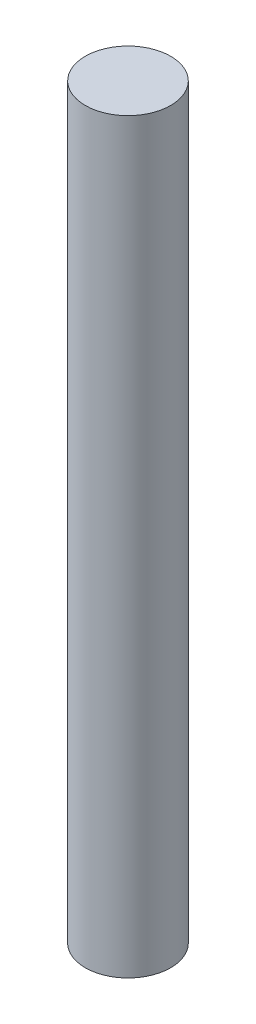
ISO-10303-21;
HEADER;
FILE_DESCRIPTION(('STEP AP214'),'2;1');
FILE_NAME('part.step','',(''),(''),'','','');
FILE_SCHEMA(('AUTOMOTIVE_DESIGN { 1 0 10303 214 1 1 1 1 }'));
ENDSEC;
DATA;
#1=APPLICATION_CONTEXT('core data for automotive mechanical design processes');
#2=APPLICATION_PROTOCOL_DEFINITION('international standard','automotive_design',2000,#1);
#3=PRODUCT_CONTEXT('',#1,'mechanical');
#4=PRODUCT('Part','Part','',(#3));
#5=PRODUCT_RELATED_PRODUCT_CATEGORY('part','',(#4));
#6=PRODUCT_DEFINITION_FORMATION('','',#4);
#7=PRODUCT_DEFINITION_CONTEXT('part definition',#1,'design');
#8=PRODUCT_DEFINITION('design','',#6,#7);
#9=PRODUCT_DEFINITION_SHAPE('','',#8);
#10=(LENGTH_UNIT() NAMED_UNIT(*) SI_UNIT(.MILLI.,.METRE.));
#11=(NAMED_UNIT(*) PLANE_ANGLE_UNIT() SI_UNIT($,.RADIAN.));
#12=(NAMED_UNIT(*) SI_UNIT($,.STERADIAN.) SOLID_ANGLE_UNIT());
#13=UNCERTAINTY_MEASURE_WITH_UNIT(LENGTH_MEASURE(1.E-05),#10,'distance_accuracy_value','');
#14=(GEOMETRIC_REPRESENTATION_CONTEXT(3) GLOBAL_UNCERTAINTY_ASSIGNED_CONTEXT((#13)) GLOBAL_UNIT_ASSIGNED_CONTEXT((#10,
#11,#12)) REPRESENTATION_CONTEXT('',''));
#15=CARTESIAN_POINT('',(0.,0.,0.));
#16=DIRECTION('',(0.,0.,1.));
#17=DIRECTION('',(1.,0.,0.));
#18=AXIS2_PLACEMENT_3D('',#15,#16,#17);
#19=CARTESIAN_POINT('',(0.,70.,0.));
#20=DIRECTION('',(0.,-1.,0.));
#21=DIRECTION('',(0.,0.,-1.));
#22=AXIS2_PLACEMENT_3D('',#19,#20,#21);
#23=CYLINDRICAL_SURFACE('',#22,4.);
#24=CARTESIAN_POINT('',(0.,70.,0.));
#25=DIRECTION('',(0.,1.,0.));
#26=DIRECTION('',(0.,0.,1.));
#27=AXIS2_PLACEMENT_3D('',#24,#25,#26);
#28=CIRCLE('',#27,4.);
#29=CARTESIAN_POINT('',(0.,70.,4.));
#30=VERTEX_POINT('',#29);
#31=EDGE_CURVE('E10',#30,#30,#28,.T.);
#32=ORIENTED_EDGE('',*,*,#31,.F.);
#33=EDGE_LOOP('',(#32));
#34=FACE_BOUND('',#33,.T.);
#35=CARTESIAN_POINT('',(0.,0.,0.));
#36=DIRECTION('',(0.,1.,0.));
#37=DIRECTION('',(0.,0.,1.));
#38=AXIS2_PLACEMENT_3D('',#35,#36,#37);
#39=CIRCLE('',#38,4.);
#40=CARTESIAN_POINT('',(0.,0.,4.));
#41=VERTEX_POINT('',#40);
#42=EDGE_CURVE('E35',#41,#41,#39,.T.);
#43=ORIENTED_EDGE('',*,*,#42,.T.);
#44=EDGE_LOOP('',(#43));
#45=FACE_BOUND('',#44,.T.);
#46=ADVANCED_FACE('F32',(#34,#45),#23,.T.);
#47=CARTESIAN_POINT('',(0.,70.,0.));
#48=DIRECTION('',(0.,1.,0.));
#49=DIRECTION('',(0.,0.,1.));
#50=AXIS2_PLACEMENT_3D('',#47,#48,#49);
#51=PLANE('',#50);
#52=ORIENTED_EDGE('',*,*,#31,.T.);
#53=EDGE_LOOP('',(#52));
#54=FACE_BOUND('',#53,.T.);
#55=ADVANCED_FACE('F47',(#54),#51,.T.);
#56=CARTESIAN_POINT('',(0.,0.,0.));
#57=DIRECTION('',(0.,1.,0.));
#58=DIRECTION('',(0.,0.,1.));
#59=AXIS2_PLACEMENT_3D('',#56,#57,#58);
#60=PLANE('',#59);
#61=ORIENTED_EDGE('',*,*,#42,.F.);
#62=EDGE_LOOP('',(#61));
#63=FACE_BOUND('',#62,.T.);
#64=ADVANCED_FACE('F45',(#63),#60,.F.);
#65=CLOSED_SHELL('',(#46,#55,#64));
#66=MANIFOLD_SOLID_BREP('B2',#65);
#67=ADVANCED_BREP_SHAPE_REPRESENTATION('',(#18,#66),#14);
#68=SHAPE_DEFINITION_REPRESENTATION(#9,#67);
ENDSEC;
END-ISO-10303-21;
